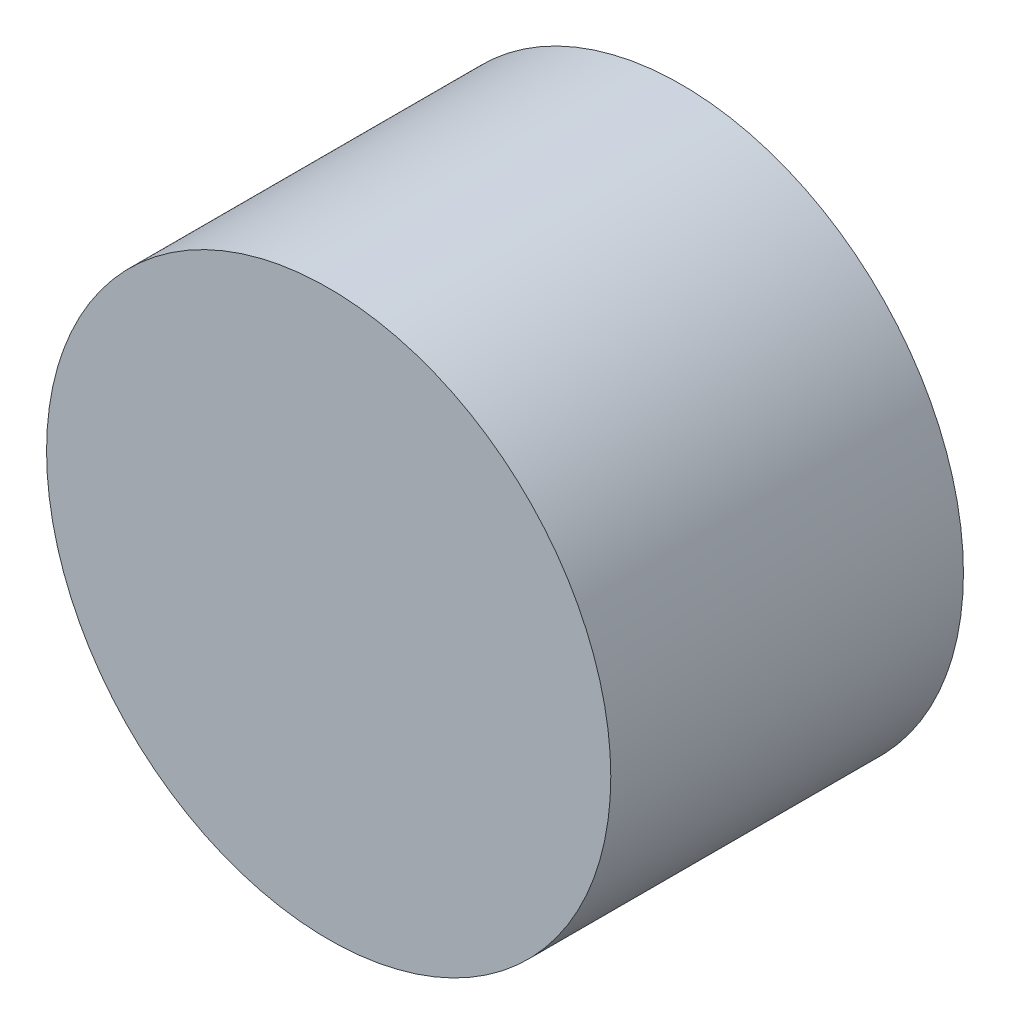
ISO-10303-21;
HEADER;
FILE_DESCRIPTION(('STEP AP214'),'2;1');
FILE_NAME('part.step','',(''),(''),'','','');
FILE_SCHEMA(('AUTOMOTIVE_DESIGN { 1 0 10303 214 1 1 1 1 }'));
ENDSEC;
DATA;
#1=APPLICATION_CONTEXT('core data for automotive mechanical design processes');
#2=APPLICATION_PROTOCOL_DEFINITION('international standard','automotive_design',2000,#1);
#3=PRODUCT_CONTEXT('',#1,'mechanical');
#4=PRODUCT('Part','Part','',(#3));
#5=PRODUCT_RELATED_PRODUCT_CATEGORY('part','',(#4));
#6=PRODUCT_DEFINITION_FORMATION('','',#4);
#7=PRODUCT_DEFINITION_CONTEXT('part definition',#1,'design');
#8=PRODUCT_DEFINITION('design','',#6,#7);
#9=PRODUCT_DEFINITION_SHAPE('','',#8);
#10=(LENGTH_UNIT() NAMED_UNIT(*) SI_UNIT(.MILLI.,.METRE.));
#11=(NAMED_UNIT(*) PLANE_ANGLE_UNIT() SI_UNIT($,.RADIAN.));
#12=(NAMED_UNIT(*) SI_UNIT($,.STERADIAN.) SOLID_ANGLE_UNIT());
#13=UNCERTAINTY_MEASURE_WITH_UNIT(LENGTH_MEASURE(1.E-05),#10,'distance_accuracy_value','');
#14=(GEOMETRIC_REPRESENTATION_CONTEXT(3) GLOBAL_UNCERTAINTY_ASSIGNED_CONTEXT((#13)) GLOBAL_UNIT_ASSIGNED_CONTEXT((#10,
#11,#12)) REPRESENTATION_CONTEXT('',''));
#15=CARTESIAN_POINT('',(0.,0.,0.));
#16=DIRECTION('',(0.,0.,1.));
#17=DIRECTION('',(1.,0.,0.));
#18=AXIS2_PLACEMENT_3D('',#15,#16,#17);
#19=CARTESIAN_POINT('',(0.,0.,50.8));
#20=DIRECTION('',(0.,0.,-1.));
#21=DIRECTION('',(-1.,0.,0.));
#22=AXIS2_PLACEMENT_3D('',#19,#20,#21);
#23=CYLINDRICAL_SURFACE('',#22,40.64);
#24=CARTESIAN_POINT('',(0.,0.,50.8));
#25=DIRECTION('',(0.,0.,1.));
#26=DIRECTION('',(1.,0.,0.));
#27=AXIS2_PLACEMENT_3D('',#24,#25,#26);
#28=CIRCLE('',#27,40.64);
#29=CARTESIAN_POINT('',(40.64,0.,50.8));
#30=VERTEX_POINT('',#29);
#31=EDGE_CURVE('E10',#30,#30,#28,.T.);
#32=ORIENTED_EDGE('',*,*,#31,.F.);
#33=EDGE_LOOP('',(#32));
#34=FACE_BOUND('',#33,.T.);
#35=CARTESIAN_POINT('',(0.,0.,0.));
#36=DIRECTION('',(0.,0.,1.));
#37=DIRECTION('',(1.,0.,0.));
#38=AXIS2_PLACEMENT_3D('',#35,#36,#37);
#39=CIRCLE('',#38,40.64);
#40=CARTESIAN_POINT('',(40.64,0.,0.));
#41=VERTEX_POINT('',#40);
#42=EDGE_CURVE('E33',#41,#41,#39,.T.);
#43=ORIENTED_EDGE('',*,*,#42,.T.);
#44=EDGE_LOOP('',(#43));
#45=FACE_BOUND('',#44,.T.);
#46=ADVANCED_FACE('F30',(#34,#45),#23,.T.);
#47=CARTESIAN_POINT('',(0.,0.,50.8));
#48=DIRECTION('',(0.,0.,1.));
#49=DIRECTION('',(1.,0.,0.));
#50=AXIS2_PLACEMENT_3D('',#47,#48,#49);
#51=PLANE('',#50);
#52=ORIENTED_EDGE('',*,*,#31,.T.);
#53=EDGE_LOOP('',(#52));
#54=FACE_BOUND('',#53,.T.);
#55=ADVANCED_FACE('F45',(#54),#51,.T.);
#56=CARTESIAN_POINT('',(0.,0.,0.));
#57=DIRECTION('',(0.,0.,1.));
#58=DIRECTION('',(1.,0.,0.));
#59=AXIS2_PLACEMENT_3D('',#56,#57,#58);
#60=PLANE('',#59);
#61=ORIENTED_EDGE('',*,*,#42,.F.);
#62=EDGE_LOOP('',(#61));
#63=FACE_BOUND('',#62,.T.);
#64=ADVANCED_FACE('F43',(#63),#60,.F.);
#65=CLOSED_SHELL('',(#46,#55,#64));
#66=MANIFOLD_SOLID_BREP('B2',#65);
#67=ADVANCED_BREP_SHAPE_REPRESENTATION('',(#18,#66),#14);
#68=SHAPE_DEFINITION_REPRESENTATION(#9,#67);
ENDSEC;
END-ISO-10303-21;
